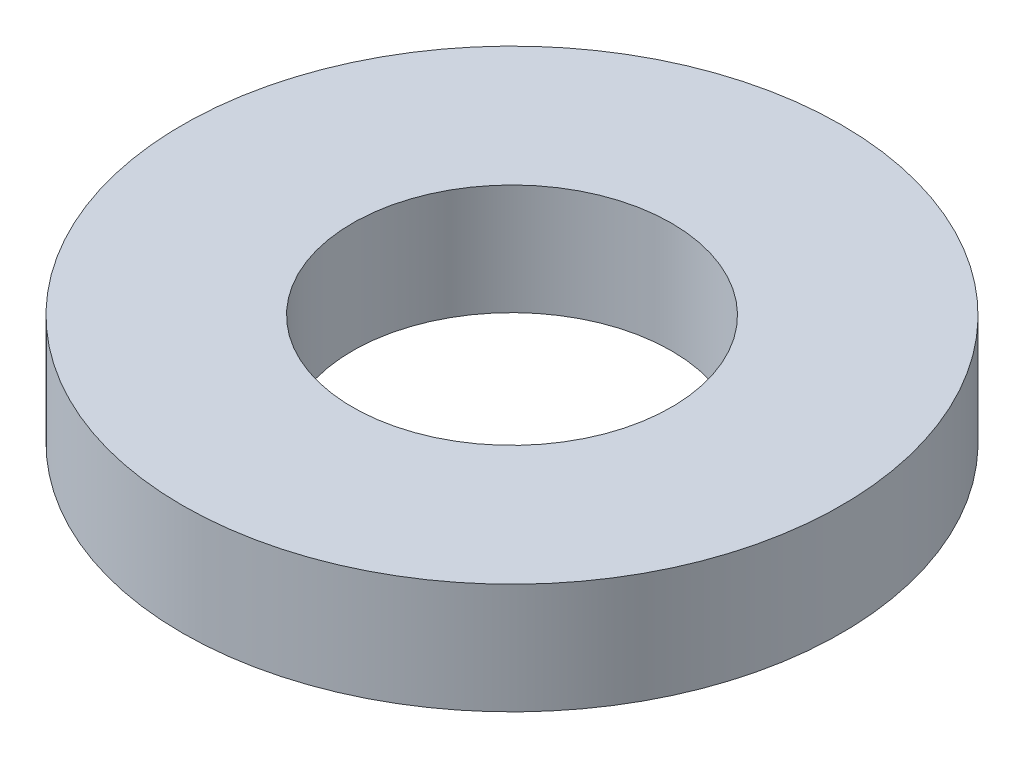
ISO-10303-21;
HEADER;
FILE_DESCRIPTION(('STEP AP214'),'2;1');
FILE_NAME('part.step','',(''),(''),'','','');
FILE_SCHEMA(('AUTOMOTIVE_DESIGN { 1 0 10303 214 1 1 1 1 }'));
ENDSEC;
DATA;
#1=APPLICATION_CONTEXT('core data for automotive mechanical design processes');
#2=APPLICATION_PROTOCOL_DEFINITION('international standard','automotive_design',2000,#1);
#3=PRODUCT_CONTEXT('',#1,'mechanical');
#4=PRODUCT('Part','Part','',(#3));
#5=PRODUCT_RELATED_PRODUCT_CATEGORY('part','',(#4));
#6=PRODUCT_DEFINITION_FORMATION('','',#4);
#7=PRODUCT_DEFINITION_CONTEXT('part definition',#1,'design');
#8=PRODUCT_DEFINITION('design','',#6,#7);
#9=PRODUCT_DEFINITION_SHAPE('','',#8);
#10=(LENGTH_UNIT() NAMED_UNIT(*) SI_UNIT(.MILLI.,.METRE.));
#11=(NAMED_UNIT(*) PLANE_ANGLE_UNIT() SI_UNIT($,.RADIAN.));
#12=(NAMED_UNIT(*) SI_UNIT($,.STERADIAN.) SOLID_ANGLE_UNIT());
#13=UNCERTAINTY_MEASURE_WITH_UNIT(LENGTH_MEASURE(1.E-05),#10,'distance_accuracy_value','');
#14=(GEOMETRIC_REPRESENTATION_CONTEXT(3) GLOBAL_UNCERTAINTY_ASSIGNED_CONTEXT((#13)) GLOBAL_UNIT_ASSIGNED_CONTEXT((#10,
#11,#12)) REPRESENTATION_CONTEXT('',''));
#15=CARTESIAN_POINT('',(0.,0.,0.));
#16=DIRECTION('',(0.,0.,1.));
#17=DIRECTION('',(1.,0.,0.));
#18=AXIS2_PLACEMENT_3D('',#15,#16,#17);
#19=CARTESIAN_POINT('',(0.,26.,0.));
#20=DIRECTION('',(0.,-1.,0.));
#21=DIRECTION('',(0.,0.,-1.));
#22=AXIS2_PLACEMENT_3D('',#19,#20,#21);
#23=CYLINDRICAL_SURFACE('',#22,77.5);
#24=CARTESIAN_POINT('',(0.,26.,0.));
#25=DIRECTION('',(0.,1.,0.));
#26=DIRECTION('',(0.,0.,1.));
#27=AXIS2_PLACEMENT_3D('',#24,#25,#26);
#28=CIRCLE('',#27,77.5);
#29=CARTESIAN_POINT('',(0.,26.,-77.5));
#30=VERTEX_POINT('',#29);
#31=EDGE_CURVE('E10',#30,#30,#28,.T.);
#32=CARTESIAN_POINT('',(0.,0.,0.));
#33=DIRECTION('',(0.,1.,0.));
#34=DIRECTION('',(0.,0.,1.));
#35=AXIS2_PLACEMENT_3D('',#32,#33,#34);
#36=CIRCLE('',#35,77.5);
#37=CARTESIAN_POINT('',(0.,0.,-77.5));
#38=VERTEX_POINT('',#37);
#39=EDGE_CURVE('E37',#38,#38,#36,.T.);
#40=CARTESIAN_POINT('',(0.,26.,-77.5));
#41=CARTESIAN_POINT('',(0.,25.7291666666667,-77.5));
#42=CARTESIAN_POINT('',(0.,25.4583333333333,-77.5));
#43=CARTESIAN_POINT('',(0.,24.9166666666667,-77.5));
#44=CARTESIAN_POINT('',(0.,24.6458333333333,-77.5));
#45=CARTESIAN_POINT('',(0.,24.1041666666667,-77.5));
#46=CARTESIAN_POINT('',(0.,23.8333333333333,-77.5));
#47=CARTESIAN_POINT('',(0.,23.2916666666667,-77.5));
#48=CARTESIAN_POINT('',(0.,23.0208333333333,-77.5));
#49=CARTESIAN_POINT('',(0.,22.4791666666667,-77.5));
#50=CARTESIAN_POINT('',(0.,22.2083333333333,-77.5));
#51=CARTESIAN_POINT('',(0.,21.6666666666667,-77.5));
#52=CARTESIAN_POINT('',(0.,21.3958333333333,-77.5));
#53=CARTESIAN_POINT('',(0.,20.8541666666667,-77.5));
#54=CARTESIAN_POINT('',(0.,20.5833333333333,-77.5));
#55=CARTESIAN_POINT('',(0.,20.0416666666667,-77.5));
#56=CARTESIAN_POINT('',(0.,19.7708333333333,-77.5));
#57=CARTESIAN_POINT('',(0.,19.2291666666667,-77.5));
#58=CARTESIAN_POINT('',(0.,18.9583333333333,-77.5));
#59=CARTESIAN_POINT('',(0.,18.4166666666667,-77.5));
#60=CARTESIAN_POINT('',(0.,18.1458333333333,-77.5));
#61=CARTESIAN_POINT('',(0.,17.6041666666667,-77.5));
#62=CARTESIAN_POINT('',(0.,17.3333333333333,-77.5));
#63=CARTESIAN_POINT('',(0.,16.7916666666667,-77.5));
#64=CARTESIAN_POINT('',(0.,16.5208333333333,-77.5));
#65=CARTESIAN_POINT('',(0.,15.9791666666667,-77.5));
#66=CARTESIAN_POINT('',(0.,15.7083333333333,-77.5));
#67=CARTESIAN_POINT('',(0.,15.1666666666667,-77.5));
#68=CARTESIAN_POINT('',(0.,14.8958333333333,-77.5));
#69=CARTESIAN_POINT('',(0.,14.3541666666667,-77.5));
#70=CARTESIAN_POINT('',(0.,14.0833333333333,-77.5));
#71=CARTESIAN_POINT('',(0.,13.5416666666667,-77.5));
#72=CARTESIAN_POINT('',(0.,13.2708333333333,-77.5));
#73=CARTESIAN_POINT('',(0.,12.7291666666667,-77.5));
#74=CARTESIAN_POINT('',(0.,12.4583333333333,-77.5));
#75=CARTESIAN_POINT('',(0.,11.9166666666667,-77.5));
#76=CARTESIAN_POINT('',(0.,11.6458333333333,-77.5));
#77=CARTESIAN_POINT('',(0.,11.1041666666667,-77.5));
#78=CARTESIAN_POINT('',(0.,10.8333333333333,-77.5));
#79=CARTESIAN_POINT('',(0.,10.2916666666667,-77.5));
#80=CARTESIAN_POINT('',(0.,10.0208333333333,-77.5));
#81=CARTESIAN_POINT('',(0.,9.47916666666667,-77.5));
#82=CARTESIAN_POINT('',(0.,9.20833333333333,-77.5));
#83=CARTESIAN_POINT('',(0.,8.66666666666667,-77.5));
#84=CARTESIAN_POINT('',(0.,8.39583333333333,-77.5));
#85=CARTESIAN_POINT('',(0.,7.85416666666667,-77.5));
#86=CARTESIAN_POINT('',(0.,7.58333333333333,-77.5));
#87=CARTESIAN_POINT('',(0.,7.04166666666667,-77.5));
#88=CARTESIAN_POINT('',(0.,6.77083333333333,-77.5));
#89=CARTESIAN_POINT('',(0.,6.22916666666667,-77.5));
#90=CARTESIAN_POINT('',(0.,5.95833333333333,-77.5));
#91=CARTESIAN_POINT('',(0.,5.41666666666667,-77.5));
#92=CARTESIAN_POINT('',(0.,5.14583333333333,-77.5));
#93=CARTESIAN_POINT('',(0.,4.60416666666667,-77.5));
#94=CARTESIAN_POINT('',(0.,4.33333333333333,-77.5));
#95=CARTESIAN_POINT('',(0.,3.79166666666667,-77.5));
#96=CARTESIAN_POINT('',(0.,3.52083333333333,-77.5));
#97=CARTESIAN_POINT('',(0.,2.97916666666667,-77.5));
#98=CARTESIAN_POINT('',(0.,2.70833333333333,-77.5));
#99=CARTESIAN_POINT('',(0.,2.16666666666667,-77.5));
#100=CARTESIAN_POINT('',(0.,1.89583333333333,-77.5));
#101=CARTESIAN_POINT('',(0.,1.35416666666667,-77.5));
#102=CARTESIAN_POINT('',(0.,1.08333333333333,-77.5));
#103=CARTESIAN_POINT('',(0.,0.541666666666667,-77.5));
#104=CARTESIAN_POINT('',(0.,0.270833333333334,-77.5));
#105=CARTESIAN_POINT('',(0.,0.,-77.5));
#106=B_SPLINE_CURVE_WITH_KNOTS('',3,(#40,#41,#42,#43,#44,#45,#46,#47,#48,#49,#50,#51,#52,#53,
#54,#55,#56,#57,#58,#59,#60,#61,#62,#63,#64,#65,#66,#67,#68,#69,#70,#71,#72,#73,#74,#75,#76,#77,
#78,#79,#80,#81,#82,#83,#84,#85,#86,#87,#88,#89,#90,#91,#92,#93,#94,#95,#96,#97,#98,#99,#100,
#101,#102,#103,#104,#105),.UNSPECIFIED.,.F.,.F.,(4,2,2,2,2,2,2,2,2,2,2,2,2,2,2,2,2,2,2,2,2,2,2,
2,2,2,2,2,2,2,2,2,4),(0.,0.812499999999997,1.625,2.4375,3.25,4.0625,4.875,5.6875,6.5,7.3125,
8.125,8.93749999999999,9.74999999999999,10.5625,11.375,12.1875,13.,13.8125,14.625,15.4375,16.25,
17.0625,17.875,18.6875,19.5,20.3125,21.125,21.9375,22.75,23.5625,24.375,25.1875,26.),.UNSPECIFIED.);
#107=EDGE_CURVE('BSEAM40',#30,#38,#106,.T.);
#108=ORIENTED_EDGE('',*,*,#31,.F.);
#109=ORIENTED_EDGE('',*,*,#39,.T.);
#110=ORIENTED_EDGE('',*,*,#107,.T.);
#111=ORIENTED_EDGE('',*,*,#107,.F.);
#112=EDGE_LOOP('',(#108,#110,#109,#111));
#113=FACE_BOUND('',#112,.T.);
#114=ADVANCED_FACE('F40',(#113),#23,.T.);
#115=CARTESIAN_POINT('',(0.,26.,0.));
#116=DIRECTION('',(0.,1.,0.));
#117=DIRECTION('',(0.,0.,1.));
#118=AXIS2_PLACEMENT_3D('',#115,#116,#117);
#119=PLANE('',#118);
#120=CARTESIAN_POINT('',(0.,26.,0.));
#121=DIRECTION('',(0.,1.,0.));
#122=DIRECTION('',(0.,0.,1.));
#123=AXIS2_PLACEMENT_3D('',#120,#121,#122);
#124=CIRCLE('',#123,37.5);
#125=CARTESIAN_POINT('',(0.,26.,-37.5));
#126=VERTEX_POINT('',#125);
#127=EDGE_CURVE('E50',#126,#126,#124,.T.);
#128=ORIENTED_EDGE('',*,*,#127,.F.);
#129=EDGE_LOOP('',(#128));
#130=FACE_BOUND('',#129,.T.);
#131=ORIENTED_EDGE('',*,*,#31,.T.);
#132=EDGE_LOOP('',(#131));
#133=FACE_BOUND('',#132,.T.);
#134=ADVANCED_FACE('F59',(#130,#133),#119,.T.);
#135=CARTESIAN_POINT('',(0.,0.,0.));
#136=DIRECTION('',(0.,1.,0.));
#137=DIRECTION('',(0.,0.,1.));
#138=AXIS2_PLACEMENT_3D('',#135,#136,#137);
#139=PLANE('',#138);
#140=CARTESIAN_POINT('',(0.,0.,0.));
#141=DIRECTION('',(0.,1.,0.));
#142=DIRECTION('',(0.,0.,1.));
#143=AXIS2_PLACEMENT_3D('',#140,#141,#142);
#144=CIRCLE('',#143,37.5);
#145=CARTESIAN_POINT('',(0.,0.,-37.5));
#146=VERTEX_POINT('',#145);
#147=EDGE_CURVE('E47',#146,#146,#144,.T.);
#148=ORIENTED_EDGE('',*,*,#147,.T.);
#149=EDGE_LOOP('',(#148));
#150=FACE_BOUND('',#149,.T.);
#151=ORIENTED_EDGE('',*,*,#39,.F.);
#152=EDGE_LOOP('',(#151));
#153=FACE_BOUND('',#152,.T.);
#154=ADVANCED_FACE('F58',(#150,#153),#139,.F.);
#155=CARTESIAN_POINT('',(0.,26.,0.));
#156=DIRECTION('',(0.,-1.,0.));
#157=DIRECTION('',(0.,0.,-1.));
#158=AXIS2_PLACEMENT_3D('',#155,#156,#157);
#159=CYLINDRICAL_SURFACE('',#158,37.5);
#160=CARTESIAN_POINT('',(0.,26.,-37.5));
#161=CARTESIAN_POINT('',(0.,25.7291666666667,-37.5));
#162=CARTESIAN_POINT('',(0.,25.4583333333333,-37.5));
#163=CARTESIAN_POINT('',(0.,24.9166666666667,-37.5));
#164=CARTESIAN_POINT('',(0.,24.6458333333333,-37.5));
#165=CARTESIAN_POINT('',(0.,24.1041666666667,-37.5));
#166=CARTESIAN_POINT('',(0.,23.8333333333333,-37.5));
#167=CARTESIAN_POINT('',(0.,23.2916666666667,-37.5));
#168=CARTESIAN_POINT('',(0.,23.0208333333333,-37.5));
#169=CARTESIAN_POINT('',(0.,22.4791666666667,-37.5));
#170=CARTESIAN_POINT('',(0.,22.2083333333333,-37.5));
#171=CARTESIAN_POINT('',(0.,21.6666666666667,-37.5));
#172=CARTESIAN_POINT('',(0.,21.3958333333333,-37.5));
#173=CARTESIAN_POINT('',(0.,20.8541666666667,-37.5));
#174=CARTESIAN_POINT('',(0.,20.5833333333333,-37.5));
#175=CARTESIAN_POINT('',(0.,20.0416666666667,-37.5));
#176=CARTESIAN_POINT('',(0.,19.7708333333333,-37.5));
#177=CARTESIAN_POINT('',(0.,19.2291666666667,-37.5));
#178=CARTESIAN_POINT('',(0.,18.9583333333333,-37.5));
#179=CARTESIAN_POINT('',(0.,18.4166666666667,-37.5));
#180=CARTESIAN_POINT('',(0.,18.1458333333333,-37.5));
#181=CARTESIAN_POINT('',(0.,17.6041666666667,-37.5));
#182=CARTESIAN_POINT('',(0.,17.3333333333333,-37.5));
#183=CARTESIAN_POINT('',(0.,16.7916666666667,-37.5));
#184=CARTESIAN_POINT('',(0.,16.5208333333333,-37.5));
#185=CARTESIAN_POINT('',(0.,15.9791666666667,-37.5));
#186=CARTESIAN_POINT('',(0.,15.7083333333333,-37.5));
#187=CARTESIAN_POINT('',(0.,15.1666666666667,-37.5));
#188=CARTESIAN_POINT('',(0.,14.8958333333333,-37.5));
#189=CARTESIAN_POINT('',(0.,14.3541666666667,-37.5));
#190=CARTESIAN_POINT('',(0.,14.0833333333333,-37.5));
#191=CARTESIAN_POINT('',(0.,13.5416666666667,-37.5));
#192=CARTESIAN_POINT('',(0.,13.2708333333333,-37.5));
#193=CARTESIAN_POINT('',(0.,12.7291666666667,-37.5));
#194=CARTESIAN_POINT('',(0.,12.4583333333333,-37.5));
#195=CARTESIAN_POINT('',(0.,11.9166666666667,-37.5));
#196=CARTESIAN_POINT('',(0.,11.6458333333333,-37.5));
#197=CARTESIAN_POINT('',(0.,11.1041666666667,-37.5));
#198=CARTESIAN_POINT('',(0.,10.8333333333333,-37.5));
#199=CARTESIAN_POINT('',(0.,10.2916666666667,-37.5));
#200=CARTESIAN_POINT('',(0.,10.0208333333333,-37.5));
#201=CARTESIAN_POINT('',(0.,9.47916666666667,-37.5));
#202=CARTESIAN_POINT('',(0.,9.20833333333333,-37.5));
#203=CARTESIAN_POINT('',(0.,8.66666666666667,-37.5));
#204=CARTESIAN_POINT('',(0.,8.39583333333333,-37.5));
#205=CARTESIAN_POINT('',(0.,7.85416666666667,-37.5));
#206=CARTESIAN_POINT('',(0.,7.58333333333333,-37.5));
#207=CARTESIAN_POINT('',(0.,7.04166666666667,-37.5));
#208=CARTESIAN_POINT('',(0.,6.77083333333333,-37.5));
#209=CARTESIAN_POINT('',(0.,6.22916666666667,-37.5));
#210=CARTESIAN_POINT('',(0.,5.95833333333333,-37.5));
#211=CARTESIAN_POINT('',(0.,5.41666666666667,-37.5));
#212=CARTESIAN_POINT('',(0.,5.14583333333333,-37.5));
#213=CARTESIAN_POINT('',(0.,4.60416666666667,-37.5));
#214=CARTESIAN_POINT('',(0.,4.33333333333333,-37.5));
#215=CARTESIAN_POINT('',(0.,3.79166666666667,-37.5));
#216=CARTESIAN_POINT('',(0.,3.52083333333333,-37.5));
#217=CARTESIAN_POINT('',(0.,2.97916666666667,-37.5));
#218=CARTESIAN_POINT('',(0.,2.70833333333333,-37.5));
#219=CARTESIAN_POINT('',(0.,2.16666666666667,-37.5));
#220=CARTESIAN_POINT('',(0.,1.89583333333333,-37.5));
#221=CARTESIAN_POINT('',(0.,1.35416666666667,-37.5));
#222=CARTESIAN_POINT('',(0.,1.08333333333333,-37.5));
#223=CARTESIAN_POINT('',(0.,0.541666666666667,-37.5));
#224=CARTESIAN_POINT('',(0.,0.270833333333334,-37.5));
#225=CARTESIAN_POINT('',(0.,0.,-37.5));
#226=B_SPLINE_CURVE_WITH_KNOTS('',3,(#160,#161,#162,#163,#164,#165,#166,#167,#168,#169,#170,
#171,#172,#173,#174,#175,#176,#177,#178,#179,#180,#181,#182,#183,#184,#185,#186,#187,#188,#189,
#190,#191,#192,#193,#194,#195,#196,#197,#198,#199,#200,#201,#202,#203,#204,#205,#206,#207,#208,
#209,#210,#211,#212,#213,#214,#215,#216,#217,#218,#219,#220,#221,#222,#223,#224,#225),
.UNSPECIFIED.,.F.,.F.,(4,2,2,2,2,2,2,2,2,2,2,2,2,2,2,2,2,2,2,2,2,2,2,2,2,2,2,2,2,2,2,2,4),(0.,
0.812499999999997,1.625,2.4375,3.25,4.0625,4.875,5.6875,6.5,7.3125,8.125,8.93749999999999,
9.74999999999999,10.5625,11.375,12.1875,13.,13.8125,14.625,15.4375,16.25,17.0625,17.875,18.6875,
19.5,20.3125,21.125,21.9375,22.75,23.5625,24.375,25.1875,26.),.UNSPECIFIED.);
#227=EDGE_CURVE('BSEAM54',#126,#146,#226,.T.);
#228=ORIENTED_EDGE('',*,*,#127,.T.);
#229=ORIENTED_EDGE('',*,*,#147,.F.);
#230=ORIENTED_EDGE('',*,*,#227,.T.);
#231=ORIENTED_EDGE('',*,*,#227,.F.);
#232=EDGE_LOOP('',(#228,#230,#229,#231));
#233=FACE_BOUND('',#232,.T.);
#234=ADVANCED_FACE('F54',(#233),#159,.F.);
#235=CLOSED_SHELL('',(#114,#134,#154,#234));
#236=MANIFOLD_SOLID_BREP('B2',#235);
#237=ADVANCED_BREP_SHAPE_REPRESENTATION('',(#18,#236),#14);
#238=SHAPE_DEFINITION_REPRESENTATION(#9,#237);
ENDSEC;
END-ISO-10303-21;
